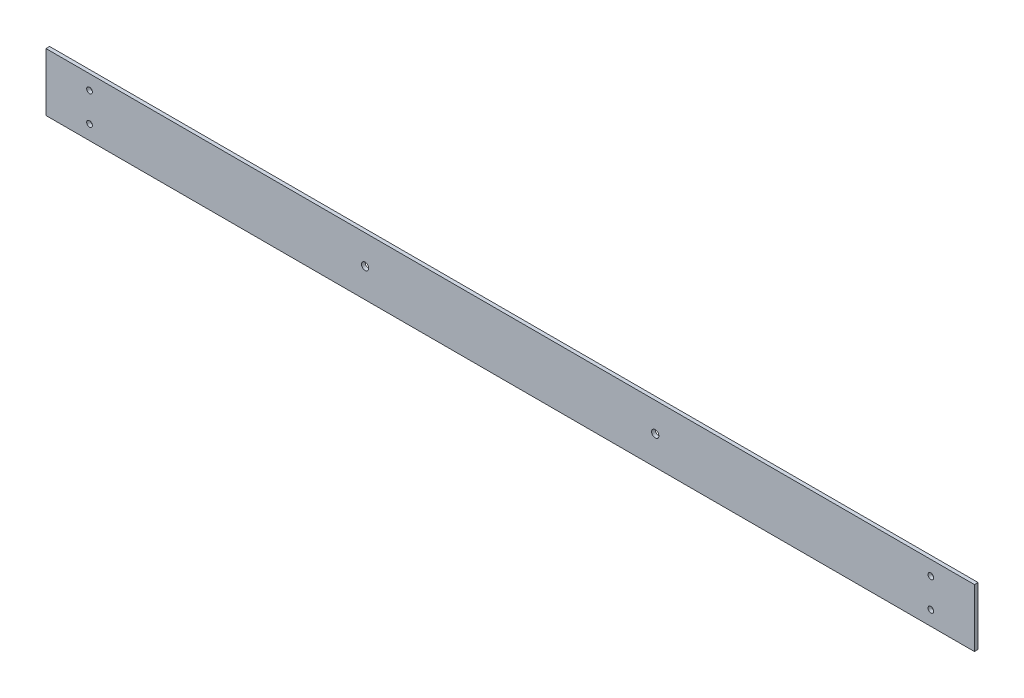
ISO-10303-21;
HEADER;
FILE_DESCRIPTION(('STEP AP214'),'2;1');
FILE_NAME('part.step','',(''),(''),'','','');
FILE_SCHEMA(('AUTOMOTIVE_DESIGN { 1 0 10303 214 1 1 1 1 }'));
ENDSEC;
DATA;
#1=APPLICATION_CONTEXT('core data for automotive mechanical design processes');
#2=APPLICATION_PROTOCOL_DEFINITION('international standard','automotive_design',2000,#1);
#3=PRODUCT_CONTEXT('',#1,'mechanical');
#4=PRODUCT('Part','Part','',(#3));
#5=PRODUCT_RELATED_PRODUCT_CATEGORY('part','',(#4));
#6=PRODUCT_DEFINITION_FORMATION('','',#4);
#7=PRODUCT_DEFINITION_CONTEXT('part definition',#1,'design');
#8=PRODUCT_DEFINITION('design','',#6,#7);
#9=PRODUCT_DEFINITION_SHAPE('','',#8);
#10=(LENGTH_UNIT() NAMED_UNIT(*) SI_UNIT(.MILLI.,.METRE.));
#11=(NAMED_UNIT(*) PLANE_ANGLE_UNIT() SI_UNIT($,.RADIAN.));
#12=(NAMED_UNIT(*) SI_UNIT($,.STERADIAN.) SOLID_ANGLE_UNIT());
#13=UNCERTAINTY_MEASURE_WITH_UNIT(LENGTH_MEASURE(1.E-05),#10,'distance_accuracy_value','');
#14=(GEOMETRIC_REPRESENTATION_CONTEXT(3) GLOBAL_UNCERTAINTY_ASSIGNED_CONTEXT((#13)) GLOBAL_UNIT_ASSIGNED_CONTEXT((#10,
#11,#12)) REPRESENTATION_CONTEXT('',''));
#15=CARTESIAN_POINT('',(0.,0.,0.));
#16=DIRECTION('',(0.,0.,1.));
#17=DIRECTION('',(1.,0.,0.));
#18=AXIS2_PLACEMENT_3D('',#15,#16,#17);
#19=CARTESIAN_POINT('',(0.,0.,3.175));
#20=DIRECTION('',(1.,0.,0.));
#21=DIRECTION('',(0.,0.,-1.));
#22=AXIS2_PLACEMENT_3D('',#19,#20,#21);
#23=PLANE('',#22);
#24=DIRECTION('',(0.,-1.,0.));
#25=VECTOR('',#24,1.);
#26=CARTESIAN_POINT('',(0.,0.,0.));
#27=LINE('',#26,#25);
#28=CARTESIAN_POINT('',(0.,50.8,0.));
#29=VERTEX_POINT('',#28);
#30=CARTESIAN_POINT('',(0.,0.,0.));
#31=VERTEX_POINT('',#30);
#32=EDGE_CURVE('E101',#29,#31,#27,.T.);
#33=ORIENTED_EDGE('',*,*,#32,.T.);
#34=DIRECTION('',(0.,0.,-1.));
#35=VECTOR('',#34,1.);
#36=CARTESIAN_POINT('',(0.,0.,3.175));
#37=LINE('',#36,#35);
#38=CARTESIAN_POINT('',(0.,0.,3.175));
#39=VERTEX_POINT('',#38);
#40=EDGE_CURVE('E11',#39,#31,#37,.T.);
#41=ORIENTED_EDGE('',*,*,#40,.F.);
#42=DIRECTION('',(0.,-1.,0.));
#43=VECTOR('',#42,1.);
#44=CARTESIAN_POINT('',(0.,0.,3.175));
#45=LINE('',#44,#43);
#46=CARTESIAN_POINT('',(0.,50.8,3.175));
#47=VERTEX_POINT('',#46);
#48=EDGE_CURVE('E89',#47,#39,#45,.T.);
#49=ORIENTED_EDGE('',*,*,#48,.F.);
#50=DIRECTION('',(0.,0.,-1.));
#51=VECTOR('',#50,1.);
#52=CARTESIAN_POINT('',(0.,50.8,3.175));
#53=LINE('',#52,#51);
#54=EDGE_CURVE('E97',#47,#29,#53,.T.);
#55=ORIENTED_EDGE('',*,*,#54,.T.);
#56=EDGE_LOOP('',(#33,#41,#49,#55));
#57=FACE_BOUND('',#56,.T.);
#58=ADVANCED_FACE('F38',(#57),#23,.F.);
#59=CARTESIAN_POINT('',(0.,0.,3.175));
#60=DIRECTION('',(0.,1.,0.));
#61=DIRECTION('',(0.,0.,1.));
#62=AXIS2_PLACEMENT_3D('',#59,#60,#61);
#63=PLANE('',#62);
#64=DIRECTION('',(1.,0.,0.));
#65=VECTOR('',#64,1.);
#66=CARTESIAN_POINT('',(0.,0.,0.));
#67=LINE('',#66,#65);
#68=CARTESIAN_POINT('',(812.8,0.,0.));
#69=VERTEX_POINT('',#68);
#70=EDGE_CURVE('E93',#31,#69,#67,.T.);
#71=ORIENTED_EDGE('',*,*,#70,.T.);
#72=DIRECTION('',(0.,0.,-1.));
#73=VECTOR('',#72,1.);
#74=CARTESIAN_POINT('',(812.8,0.,3.175));
#75=LINE('',#74,#73);
#76=CARTESIAN_POINT('',(812.8,0.,3.175));
#77=VERTEX_POINT('',#76);
#78=EDGE_CURVE('E46',#77,#69,#75,.T.);
#79=ORIENTED_EDGE('',*,*,#78,.F.);
#80=DIRECTION('',(1.,0.,0.));
#81=VECTOR('',#80,1.);
#82=CARTESIAN_POINT('',(0.,0.,3.175));
#83=LINE('',#82,#81);
#84=EDGE_CURVE('E84',#39,#77,#83,.T.);
#85=ORIENTED_EDGE('',*,*,#84,.F.);
#86=ORIENTED_EDGE('',*,*,#40,.T.);
#87=EDGE_LOOP('',(#71,#79,#85,#86));
#88=FACE_BOUND('',#87,.T.);
#89=ADVANCED_FACE('F92',(#88),#63,.F.);
#90=CARTESIAN_POINT('',(812.8,0.,3.175));
#91=DIRECTION('',(-1.,0.,0.));
#92=DIRECTION('',(0.,0.,1.));
#93=AXIS2_PLACEMENT_3D('',#90,#91,#92);
#94=PLANE('',#93);
#95=DIRECTION('',(0.,1.,0.));
#96=VECTOR('',#95,1.);
#97=CARTESIAN_POINT('',(812.8,0.,0.));
#98=LINE('',#97,#96);
#99=CARTESIAN_POINT('',(812.8,50.8,0.));
#100=VERTEX_POINT('',#99);
#101=EDGE_CURVE('E71',#69,#100,#98,.T.);
#102=ORIENTED_EDGE('',*,*,#101,.T.);
#103=DIRECTION('',(0.,0.,-1.));
#104=VECTOR('',#103,1.);
#105=CARTESIAN_POINT('',(812.8,50.8,3.175));
#106=LINE('',#105,#104);
#107=CARTESIAN_POINT('',(812.8,50.8,3.175));
#108=VERTEX_POINT('',#107);
#109=EDGE_CURVE('E94',#108,#100,#106,.T.);
#110=ORIENTED_EDGE('',*,*,#109,.F.);
#111=DIRECTION('',(0.,1.,0.));
#112=VECTOR('',#111,1.);
#113=CARTESIAN_POINT('',(812.8,0.,3.175));
#114=LINE('',#113,#112);
#115=EDGE_CURVE('E87',#77,#108,#114,.T.);
#116=ORIENTED_EDGE('',*,*,#115,.F.);
#117=ORIENTED_EDGE('',*,*,#78,.T.);
#118=EDGE_LOOP('',(#102,#110,#116,#117));
#119=FACE_BOUND('',#118,.T.);
#120=ADVANCED_FACE('F95',(#119),#94,.F.);
#121=CARTESIAN_POINT('',(0.,50.8,3.175));
#122=DIRECTION('',(0.,-1.,0.));
#123=DIRECTION('',(0.,0.,-1.));
#124=AXIS2_PLACEMENT_3D('',#121,#122,#123);
#125=PLANE('',#124);
#126=DIRECTION('',(-1.,0.,0.));
#127=VECTOR('',#126,1.);
#128=CARTESIAN_POINT('',(0.,50.8,0.));
#129=LINE('',#128,#127);
#130=EDGE_CURVE('E77',#100,#29,#129,.T.);
#131=ORIENTED_EDGE('',*,*,#130,.T.);
#132=ORIENTED_EDGE('',*,*,#54,.F.);
#133=DIRECTION('',(-1.,0.,0.));
#134=VECTOR('',#133,1.);
#135=CARTESIAN_POINT('',(0.,50.8,3.175));
#136=LINE('',#135,#134);
#137=EDGE_CURVE('E54',#108,#47,#136,.T.);
#138=ORIENTED_EDGE('',*,*,#137,.F.);
#139=ORIENTED_EDGE('',*,*,#109,.T.);
#140=EDGE_LOOP('',(#131,#132,#138,#139));
#141=FACE_BOUND('',#140,.T.);
#142=ADVANCED_FACE('F109',(#141),#125,.F.);
#143=CARTESIAN_POINT('',(0.,0.,3.175));
#144=DIRECTION('',(0.,0.,-1.));
#145=DIRECTION('',(-1.,0.,0.));
#146=AXIS2_PLACEMENT_3D('',#143,#144,#145);
#147=PLANE('',#146);
#148=CARTESIAN_POINT('',(774.7,12.7,3.175));
#149=DIRECTION('',(0.,0.,-1.));
#150=DIRECTION('',(-1.,0.,0.));
#151=AXIS2_PLACEMENT_3D('',#148,#149,#150);
#152=CIRCLE('',#151,2.48919999999995);
#153=CARTESIAN_POINT('',(772.2108,12.7,3.175));
#154=VERTEX_POINT('',#153);
#155=EDGE_CURVE('E136',#154,#154,#152,.T.);
#156=ORIENTED_EDGE('',*,*,#155,.T.);
#157=EDGE_LOOP('',(#156));
#158=FACE_BOUND('',#157,.T.);
#159=CARTESIAN_POINT('',(38.1,38.1,3.175));
#160=DIRECTION('',(0.,0.,-1.));
#161=DIRECTION('',(-1.,0.,0.));
#162=AXIS2_PLACEMENT_3D('',#159,#160,#161);
#163=CIRCLE('',#162,2.4892);
#164=CARTESIAN_POINT('',(35.6108,38.1,3.175));
#165=VERTEX_POINT('',#164);
#166=EDGE_CURVE('E125',#165,#165,#163,.T.);
#167=ORIENTED_EDGE('',*,*,#166,.T.);
#168=EDGE_LOOP('',(#167));
#169=FACE_BOUND('',#168,.T.);
#170=CARTESIAN_POINT('',(38.1,12.7,3.175));
#171=DIRECTION('',(0.,0.,-1.));
#172=DIRECTION('',(-1.,0.,0.));
#173=AXIS2_PLACEMENT_3D('',#170,#171,#172);
#174=CIRCLE('',#173,2.4892);
#175=CARTESIAN_POINT('',(35.6108,12.7,3.175));
#176=VERTEX_POINT('',#175);
#177=EDGE_CURVE('E124',#176,#176,#174,.T.);
#178=ORIENTED_EDGE('',*,*,#177,.T.);
#179=EDGE_LOOP('',(#178));
#180=FACE_BOUND('',#179,.T.);
#181=CARTESIAN_POINT('',(279.4,25.4,3.175));
#182=DIRECTION('',(0.,0.,-1.));
#183=DIRECTION('',(-1.,0.,0.));
#184=AXIS2_PLACEMENT_3D('',#181,#182,#183);
#185=CIRCLE('',#184,3.17499999999997);
#186=CARTESIAN_POINT('',(276.225,25.4,3.175));
#187=VERTEX_POINT('',#186);
#188=EDGE_CURVE('E118',#187,#187,#185,.T.);
#189=ORIENTED_EDGE('',*,*,#188,.T.);
#190=EDGE_LOOP('',(#189));
#191=FACE_BOUND('',#190,.T.);
#192=CARTESIAN_POINT('',(774.7,38.1,3.175));
#193=DIRECTION('',(0.,0.,-1.));
#194=DIRECTION('',(-1.,0.,0.));
#195=AXIS2_PLACEMENT_3D('',#192,#193,#194);
#196=CIRCLE('',#195,2.48919999999995);
#197=CARTESIAN_POINT('',(772.2108,38.1,3.175));
#198=VERTEX_POINT('',#197);
#199=EDGE_CURVE('E137',#198,#198,#196,.T.);
#200=ORIENTED_EDGE('',*,*,#199,.T.);
#201=EDGE_LOOP('',(#200));
#202=FACE_BOUND('',#201,.T.);
#203=CARTESIAN_POINT('',(533.4,25.4,3.175));
#204=DIRECTION('',(0.,0.,-1.));
#205=DIRECTION('',(-1.,0.,0.));
#206=AXIS2_PLACEMENT_3D('',#203,#204,#205);
#207=CIRCLE('',#206,3.17500000000008);
#208=CARTESIAN_POINT('',(530.225,25.4,3.175));
#209=VERTEX_POINT('',#208);
#210=EDGE_CURVE('E104',#209,#209,#207,.T.);
#211=ORIENTED_EDGE('',*,*,#210,.T.);
#212=EDGE_LOOP('',(#211));
#213=FACE_BOUND('',#212,.T.);
#214=ORIENTED_EDGE('',*,*,#48,.T.);
#215=ORIENTED_EDGE('',*,*,#84,.T.);
#216=ORIENTED_EDGE('',*,*,#115,.T.);
#217=ORIENTED_EDGE('',*,*,#137,.T.);
#218=EDGE_LOOP('',(#214,#215,#216,#217));
#219=FACE_BOUND('',#218,.T.);
#220=ADVANCED_FACE('F85',(#158,#169,#180,#191,#202,#213,#219),#147,.F.);
#221=CARTESIAN_POINT('',(0.,0.,0.));
#222=DIRECTION('',(0.,0.,-1.));
#223=DIRECTION('',(-1.,0.,0.));
#224=AXIS2_PLACEMENT_3D('',#221,#222,#223);
#225=PLANE('',#224);
#226=CARTESIAN_POINT('',(774.7,12.7,0.));
#227=DIRECTION('',(0.,0.,-1.));
#228=DIRECTION('',(-1.,0.,0.));
#229=AXIS2_PLACEMENT_3D('',#226,#227,#228);
#230=CIRCLE('',#229,2.48919999999995);
#231=CARTESIAN_POINT('',(772.2108,12.7,0.));
#232=VERTEX_POINT('',#231);
#233=EDGE_CURVE('E133',#232,#232,#230,.T.);
#234=ORIENTED_EDGE('',*,*,#233,.F.);
#235=EDGE_LOOP('',(#234));
#236=FACE_BOUND('',#235,.T.);
#237=CARTESIAN_POINT('',(38.1,38.1,0.));
#238=DIRECTION('',(0.,0.,-1.));
#239=DIRECTION('',(-1.,0.,0.));
#240=AXIS2_PLACEMENT_3D('',#237,#238,#239);
#241=CIRCLE('',#240,2.4892);
#242=CARTESIAN_POINT('',(35.6108,38.1,0.));
#243=VERTEX_POINT('',#242);
#244=EDGE_CURVE('E140',#243,#243,#241,.T.);
#245=ORIENTED_EDGE('',*,*,#244,.F.);
#246=EDGE_LOOP('',(#245));
#247=FACE_BOUND('',#246,.T.);
#248=CARTESIAN_POINT('',(38.1,12.7,0.));
#249=DIRECTION('',(0.,0.,-1.));
#250=DIRECTION('',(-1.,0.,0.));
#251=AXIS2_PLACEMENT_3D('',#248,#249,#250);
#252=CIRCLE('',#251,2.4892);
#253=CARTESIAN_POINT('',(35.6108,12.7,0.));
#254=VERTEX_POINT('',#253);
#255=EDGE_CURVE('E121',#254,#254,#252,.T.);
#256=ORIENTED_EDGE('',*,*,#255,.F.);
#257=EDGE_LOOP('',(#256));
#258=FACE_BOUND('',#257,.T.);
#259=CARTESIAN_POINT('',(279.4,25.4,0.));
#260=DIRECTION('',(0.,0.,-1.));
#261=DIRECTION('',(-1.,0.,0.));
#262=AXIS2_PLACEMENT_3D('',#259,#260,#261);
#263=CIRCLE('',#262,3.17499999999997);
#264=CARTESIAN_POINT('',(276.225,25.4,0.));
#265=VERTEX_POINT('',#264);
#266=EDGE_CURVE('E128',#265,#265,#263,.T.);
#267=ORIENTED_EDGE('',*,*,#266,.F.);
#268=EDGE_LOOP('',(#267));
#269=FACE_BOUND('',#268,.T.);
#270=CARTESIAN_POINT('',(774.7,38.1,0.));
#271=DIRECTION('',(0.,0.,-1.));
#272=DIRECTION('',(-1.,0.,0.));
#273=AXIS2_PLACEMENT_3D('',#270,#271,#272);
#274=CIRCLE('',#273,2.48919999999995);
#275=CARTESIAN_POINT('',(772.2108,38.1,0.));
#276=VERTEX_POINT('',#275);
#277=EDGE_CURVE('E145',#276,#276,#274,.T.);
#278=ORIENTED_EDGE('',*,*,#277,.F.);
#279=EDGE_LOOP('',(#278));
#280=FACE_BOUND('',#279,.T.);
#281=CARTESIAN_POINT('',(533.4,25.4,0.));
#282=DIRECTION('',(0.,0.,-1.));
#283=DIRECTION('',(-1.,0.,0.));
#284=AXIS2_PLACEMENT_3D('',#281,#282,#283);
#285=CIRCLE('',#284,3.17500000000008);
#286=CARTESIAN_POINT('',(530.225,25.4,0.));
#287=VERTEX_POINT('',#286);
#288=EDGE_CURVE('E115',#287,#287,#285,.T.);
#289=ORIENTED_EDGE('',*,*,#288,.F.);
#290=EDGE_LOOP('',(#289));
#291=FACE_BOUND('',#290,.T.);
#292=ORIENTED_EDGE('',*,*,#32,.F.);
#293=ORIENTED_EDGE('',*,*,#130,.F.);
#294=ORIENTED_EDGE('',*,*,#101,.F.);
#295=ORIENTED_EDGE('',*,*,#70,.F.);
#296=EDGE_LOOP('',(#292,#293,#294,#295));
#297=FACE_BOUND('',#296,.T.);
#298=ADVANCED_FACE('F112',(#236,#247,#258,#269,#280,#291,#297),#225,.T.);
#299=CARTESIAN_POINT('',(533.4,25.4,3.175));
#300=DIRECTION('',(0.,0.,-1.));
#301=DIRECTION('',(-1.,0.,0.));
#302=AXIS2_PLACEMENT_3D('',#299,#300,#301);
#303=CYLINDRICAL_SURFACE('',#302,3.17500000000008);
#304=ORIENTED_EDGE('',*,*,#210,.F.);
#305=EDGE_LOOP('',(#304));
#306=FACE_BOUND('',#305,.T.);
#307=ORIENTED_EDGE('',*,*,#288,.T.);
#308=EDGE_LOOP('',(#307));
#309=FACE_BOUND('',#308,.T.);
#310=ADVANCED_FACE('F157',(#306,#309),#303,.F.);
#311=CARTESIAN_POINT('',(774.7,38.1,3.175));
#312=DIRECTION('',(0.,0.,-1.));
#313=DIRECTION('',(-1.,0.,0.));
#314=AXIS2_PLACEMENT_3D('',#311,#312,#313);
#315=CYLINDRICAL_SURFACE('',#314,2.48919999999995);
#316=ORIENTED_EDGE('',*,*,#199,.F.);
#317=EDGE_LOOP('',(#316));
#318=FACE_BOUND('',#317,.T.);
#319=ORIENTED_EDGE('',*,*,#277,.T.);
#320=EDGE_LOOP('',(#319));
#321=FACE_BOUND('',#320,.T.);
#322=ADVANCED_FACE('F153',(#318,#321),#315,.F.);
#323=CARTESIAN_POINT('',(279.4,25.4,3.175));
#324=DIRECTION('',(0.,0.,-1.));
#325=DIRECTION('',(-1.,0.,0.));
#326=AXIS2_PLACEMENT_3D('',#323,#324,#325);
#327=CYLINDRICAL_SURFACE('',#326,3.17499999999997);
#328=ORIENTED_EDGE('',*,*,#188,.F.);
#329=EDGE_LOOP('',(#328));
#330=FACE_BOUND('',#329,.T.);
#331=ORIENTED_EDGE('',*,*,#266,.T.);
#332=EDGE_LOOP('',(#331));
#333=FACE_BOUND('',#332,.T.);
#334=ADVANCED_FACE('F156',(#330,#333),#327,.F.);
#335=CARTESIAN_POINT('',(38.1,12.7,3.175));
#336=DIRECTION('',(0.,0.,-1.));
#337=DIRECTION('',(-1.,0.,0.));
#338=AXIS2_PLACEMENT_3D('',#335,#336,#337);
#339=CYLINDRICAL_SURFACE('',#338,2.4892);
#340=ORIENTED_EDGE('',*,*,#177,.F.);
#341=EDGE_LOOP('',(#340));
#342=FACE_BOUND('',#341,.T.);
#343=ORIENTED_EDGE('',*,*,#255,.T.);
#344=EDGE_LOOP('',(#343));
#345=FACE_BOUND('',#344,.T.);
#346=ADVANCED_FACE('F199',(#342,#345),#339,.F.);
#347=CARTESIAN_POINT('',(38.1,38.1,3.175));
#348=DIRECTION('',(0.,0.,-1.));
#349=DIRECTION('',(-1.,0.,0.));
#350=AXIS2_PLACEMENT_3D('',#347,#348,#349);
#351=CYLINDRICAL_SURFACE('',#350,2.4892);
#352=ORIENTED_EDGE('',*,*,#166,.F.);
#353=EDGE_LOOP('',(#352));
#354=FACE_BOUND('',#353,.T.);
#355=ORIENTED_EDGE('',*,*,#244,.T.);
#356=EDGE_LOOP('',(#355));
#357=FACE_BOUND('',#356,.T.);
#358=ADVANCED_FACE('F206',(#354,#357),#351,.F.);
#359=CARTESIAN_POINT('',(774.7,12.7,3.175));
#360=DIRECTION('',(0.,0.,-1.));
#361=DIRECTION('',(-1.,0.,0.));
#362=AXIS2_PLACEMENT_3D('',#359,#360,#361);
#363=CYLINDRICAL_SURFACE('',#362,2.48919999999995);
#364=ORIENTED_EDGE('',*,*,#155,.F.);
#365=EDGE_LOOP('',(#364));
#366=FACE_BOUND('',#365,.T.);
#367=ORIENTED_EDGE('',*,*,#233,.T.);
#368=EDGE_LOOP('',(#367));
#369=FACE_BOUND('',#368,.T.);
#370=ADVANCED_FACE('F209',(#366,#369),#363,.F.);
#371=CLOSED_SHELL('',(#58,#89,#120,#142,#220,#298,#310,#322,#334,#346,#358,#370));
#372=MANIFOLD_SOLID_BREP('B2',#371);
#373=ADVANCED_BREP_SHAPE_REPRESENTATION('',(#18,#372),#14);
#374=SHAPE_DEFINITION_REPRESENTATION(#9,#373);
ENDSEC;
END-ISO-10303-21;
